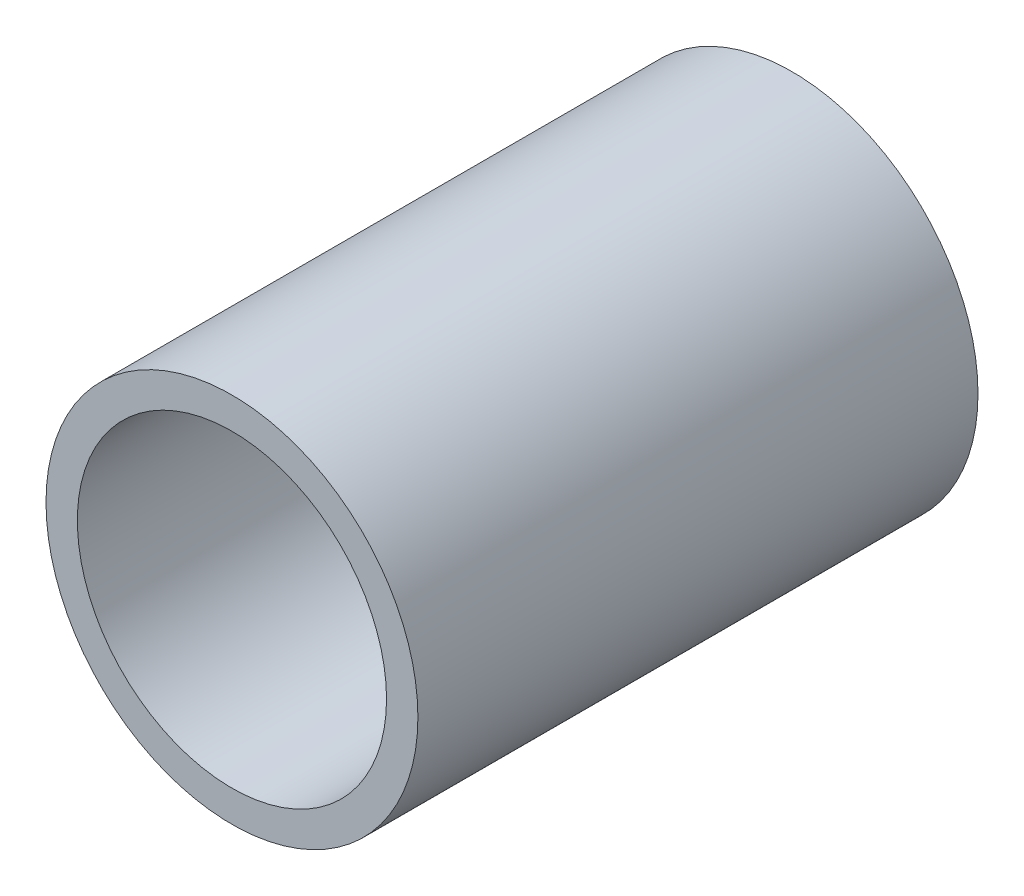
ISO-10303-21;
HEADER;
FILE_DESCRIPTION(('STEP AP214'),'2;1');
FILE_NAME('part.step','',(''),(''),'','','');
FILE_SCHEMA(('AUTOMOTIVE_DESIGN { 1 0 10303 214 1 1 1 1 }'));
ENDSEC;
DATA;
#1=APPLICATION_CONTEXT('core data for automotive mechanical design processes');
#2=APPLICATION_PROTOCOL_DEFINITION('international standard','automotive_design',2000,#1);
#3=PRODUCT_CONTEXT('',#1,'mechanical');
#4=PRODUCT('Part','Part','',(#3));
#5=PRODUCT_RELATED_PRODUCT_CATEGORY('part','',(#4));
#6=PRODUCT_DEFINITION_FORMATION('','',#4);
#7=PRODUCT_DEFINITION_CONTEXT('part definition',#1,'design');
#8=PRODUCT_DEFINITION('design','',#6,#7);
#9=PRODUCT_DEFINITION_SHAPE('','',#8);
#10=(LENGTH_UNIT() NAMED_UNIT(*) SI_UNIT(.MILLI.,.METRE.));
#11=(NAMED_UNIT(*) PLANE_ANGLE_UNIT() SI_UNIT($,.RADIAN.));
#12=(NAMED_UNIT(*) SI_UNIT($,.STERADIAN.) SOLID_ANGLE_UNIT());
#13=UNCERTAINTY_MEASURE_WITH_UNIT(LENGTH_MEASURE(1.E-05),#10,'distance_accuracy_value','');
#14=(GEOMETRIC_REPRESENTATION_CONTEXT(3) GLOBAL_UNCERTAINTY_ASSIGNED_CONTEXT((#13)) GLOBAL_UNIT_ASSIGNED_CONTEXT((#10,
#11,#12)) REPRESENTATION_CONTEXT('',''));
#15=CARTESIAN_POINT('',(0.,0.,0.));
#16=DIRECTION('',(0.,0.,1.));
#17=DIRECTION('',(1.,0.,0.));
#18=AXIS2_PLACEMENT_3D('',#15,#16,#17);
#19=CARTESIAN_POINT('',(574.675,28.575,63.5));
#20=DIRECTION('',(0.,0.,1.));
#21=DIRECTION('',(1.,0.,0.));
#22=AXIS2_PLACEMENT_3D('',#19,#20,#21);
#23=CYLINDRICAL_SURFACE('',#22,17.526);
#24=CARTESIAN_POINT('',(574.675,28.575,0.));
#25=DIRECTION('',(0.,0.,1.));
#26=DIRECTION('',(1.,0.,0.));
#27=AXIS2_PLACEMENT_3D('',#24,#25,#26);
#28=CIRCLE('',#27,17.526);
#29=CARTESIAN_POINT('',(592.201,28.575,0.));
#30=VERTEX_POINT('',#29);
#31=EDGE_CURVE('E24',#30,#30,#28,.T.);
#32=ORIENTED_EDGE('',*,*,#31,.F.);
#33=EDGE_LOOP('',(#32));
#34=FACE_BOUND('',#33,.T.);
#35=CARTESIAN_POINT('',(574.675,28.575,63.5));
#36=DIRECTION('',(0.,0.,1.));
#37=DIRECTION('',(1.,0.,0.));
#38=AXIS2_PLACEMENT_3D('',#35,#36,#37);
#39=CIRCLE('',#38,17.526);
#40=CARTESIAN_POINT('',(592.201,28.575,63.5));
#41=VERTEX_POINT('',#40);
#42=EDGE_CURVE('E15',#41,#41,#39,.T.);
#43=ORIENTED_EDGE('',*,*,#42,.T.);
#44=EDGE_LOOP('',(#43));
#45=FACE_BOUND('',#44,.T.);
#46=ADVANCED_FACE('F12',(#34,#45),#23,.F.);
#47=CARTESIAN_POINT('',(39.116,38.1,63.5));
#48=DIRECTION('',(0.,0.,-1.));
#49=DIRECTION('',(-1.,0.,0.));
#50=AXIS2_PLACEMENT_3D('',#47,#48,#49);
#51=PLANE('',#50);
#52=CARTESIAN_POINT('',(574.675,28.575,63.5));
#53=DIRECTION('',(0.,0.,1.));
#54=DIRECTION('',(1.,0.,0.));
#55=AXIS2_PLACEMENT_3D('',#52,#53,#54);
#56=CIRCLE('',#55,21.082);
#57=CARTESIAN_POINT('',(595.757,28.575,63.5));
#58=VERTEX_POINT('',#57);
#59=EDGE_CURVE('E19',#58,#58,#56,.F.);
#60=ORIENTED_EDGE('',*,*,#59,.F.);
#61=EDGE_LOOP('',(#60));
#62=FACE_BOUND('',#61,.T.);
#63=ORIENTED_EDGE('',*,*,#42,.F.);
#64=EDGE_LOOP('',(#63));
#65=FACE_BOUND('',#64,.T.);
#66=ADVANCED_FACE('F33',(#62,#65),#51,.F.);
#67=CARTESIAN_POINT('',(39.116,38.1,0.));
#68=DIRECTION('',(0.,0.,-1.));
#69=DIRECTION('',(-1.,0.,0.));
#70=AXIS2_PLACEMENT_3D('',#67,#68,#69);
#71=PLANE('',#70);
#72=CARTESIAN_POINT('',(574.675,28.575,0.));
#73=DIRECTION('',(0.,0.,1.));
#74=DIRECTION('',(1.,0.,0.));
#75=AXIS2_PLACEMENT_3D('',#72,#73,#74);
#76=CIRCLE('',#75,21.082);
#77=CARTESIAN_POINT('',(595.757,28.575,0.));
#78=VERTEX_POINT('',#77);
#79=EDGE_CURVE('E8',#78,#78,#76,.T.);
#80=ORIENTED_EDGE('',*,*,#79,.F.);
#81=EDGE_LOOP('',(#80));
#82=FACE_BOUND('',#81,.T.);
#83=ORIENTED_EDGE('',*,*,#31,.T.);
#84=EDGE_LOOP('',(#83));
#85=FACE_BOUND('',#84,.T.);
#86=ADVANCED_FACE('F35',(#82,#85),#71,.T.);
#87=CARTESIAN_POINT('',(574.675,28.575,63.5));
#88=DIRECTION('',(0.,0.,1.));
#89=DIRECTION('',(1.,0.,0.));
#90=AXIS2_PLACEMENT_3D('',#87,#88,#89);
#91=CYLINDRICAL_SURFACE('',#90,21.082);
#92=ORIENTED_EDGE('',*,*,#79,.T.);
#93=EDGE_LOOP('',(#92));
#94=FACE_BOUND('',#93,.T.);
#95=ORIENTED_EDGE('',*,*,#59,.T.);
#96=EDGE_LOOP('',(#95));
#97=FACE_BOUND('',#96,.T.);
#98=ADVANCED_FACE('F42',(#94,#97),#91,.T.);
#99=CLOSED_SHELL('',(#46,#66,#86,#98));
#100=MANIFOLD_SOLID_BREP('B1',#99);
#101=ADVANCED_BREP_SHAPE_REPRESENTATION('',(#18,#100),#14);
#102=SHAPE_DEFINITION_REPRESENTATION(#9,#101);
ENDSEC;
END-ISO-10303-21;
